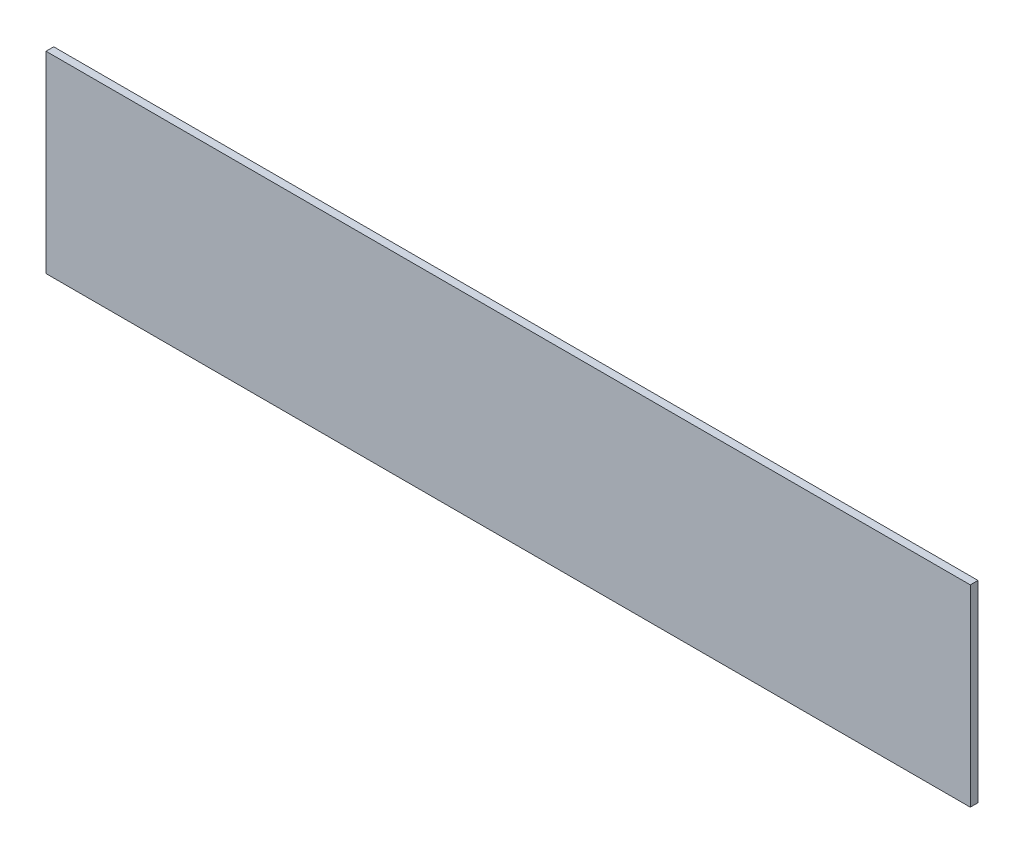
ISO-10303-21;
HEADER;
FILE_DESCRIPTION(('STEP AP214'),'2;1');
FILE_NAME('part.step','',(''),(''),'','','');
FILE_SCHEMA(('AUTOMOTIVE_DESIGN { 1 0 10303 214 1 1 1 1 }'));
ENDSEC;
DATA;
#1=APPLICATION_CONTEXT('core data for automotive mechanical design processes');
#2=APPLICATION_PROTOCOL_DEFINITION('international standard','automotive_design',2000,#1);
#3=PRODUCT_CONTEXT('',#1,'mechanical');
#4=PRODUCT('Part','Part','',(#3));
#5=PRODUCT_RELATED_PRODUCT_CATEGORY('part','',(#4));
#6=PRODUCT_DEFINITION_FORMATION('','',#4);
#7=PRODUCT_DEFINITION_CONTEXT('part definition',#1,'design');
#8=PRODUCT_DEFINITION('design','',#6,#7);
#9=PRODUCT_DEFINITION_SHAPE('','',#8);
#10=(LENGTH_UNIT() NAMED_UNIT(*) SI_UNIT(.MILLI.,.METRE.));
#11=(NAMED_UNIT(*) PLANE_ANGLE_UNIT() SI_UNIT($,.RADIAN.));
#12=(NAMED_UNIT(*) SI_UNIT($,.STERADIAN.) SOLID_ANGLE_UNIT());
#13=UNCERTAINTY_MEASURE_WITH_UNIT(LENGTH_MEASURE(1.E-05),#10,'distance_accuracy_value','');
#14=(GEOMETRIC_REPRESENTATION_CONTEXT(3) GLOBAL_UNCERTAINTY_ASSIGNED_CONTEXT((#13)) GLOBAL_UNIT_ASSIGNED_CONTEXT((#10,
#11,#12)) REPRESENTATION_CONTEXT('',''));
#15=CARTESIAN_POINT('',(0.,0.,0.));
#16=DIRECTION('',(0.,0.,1.));
#17=DIRECTION('',(1.,0.,0.));
#18=AXIS2_PLACEMENT_3D('',#15,#16,#17);
#19=CARTESIAN_POINT('',(0.,0.,-20.));
#20=DIRECTION('',(-1.,0.,0.));
#21=DIRECTION('',(0.,-1.,0.));
#22=AXIS2_PLACEMENT_3D('',#19,#20,#21);
#23=PLANE('',#22);
#24=DIRECTION('',(0.,-1.,0.));
#25=VECTOR('',#24,1.);
#26=CARTESIAN_POINT('',(0.,0.,0.));
#27=LINE('',#26,#25);
#28=CARTESIAN_POINT('',(0.,0.,0.));
#29=VERTEX_POINT('',#28);
#30=CARTESIAN_POINT('',(0.,-500.,0.));
#31=VERTEX_POINT('',#30);
#32=EDGE_CURVE('E103',#29,#31,#27,.T.);
#33=ORIENTED_EDGE('',*,*,#32,.F.);
#34=DIRECTION('',(0.,0.,1.));
#35=VECTOR('',#34,1.);
#36=CARTESIAN_POINT('',(0.,0.,-20.));
#37=LINE('',#36,#35);
#38=CARTESIAN_POINT('',(0.,0.,-20.));
#39=VERTEX_POINT('',#38);
#40=EDGE_CURVE('E11',#39,#29,#37,.T.);
#41=ORIENTED_EDGE('',*,*,#40,.F.);
#42=DIRECTION('',(0.,-1.,0.));
#43=VECTOR('',#42,1.);
#44=CARTESIAN_POINT('',(0.,0.,-20.));
#45=LINE('',#44,#43);
#46=CARTESIAN_POINT('',(0.,-500.,-20.));
#47=VERTEX_POINT('',#46);
#48=EDGE_CURVE('E97',#39,#47,#45,.T.);
#49=ORIENTED_EDGE('',*,*,#48,.T.);
#50=DIRECTION('',(0.,0.,1.));
#51=VECTOR('',#50,1.);
#52=CARTESIAN_POINT('',(0.,-500.,-20.));
#53=LINE('',#52,#51);
#54=EDGE_CURVE('E42',#47,#31,#53,.T.);
#55=ORIENTED_EDGE('',*,*,#54,.T.);
#56=EDGE_LOOP('',(#33,#41,#49,#55));
#57=FACE_BOUND('',#56,.T.);
#58=ADVANCED_FACE('F39',(#57),#23,.T.);
#59=CARTESIAN_POINT('',(0.,0.,-20.));
#60=DIRECTION('',(0.,1.,0.));
#61=DIRECTION('',(0.,0.,1.));
#62=AXIS2_PLACEMENT_3D('',#59,#60,#61);
#63=PLANE('',#62);
#64=DIRECTION('',(-1.,0.,0.));
#65=VECTOR('',#64,1.);
#66=CARTESIAN_POINT('',(0.,0.,0.));
#67=LINE('',#66,#65);
#68=CARTESIAN_POINT('',(2400.,0.,0.));
#69=VERTEX_POINT('',#68);
#70=EDGE_CURVE('E99',#69,#29,#67,.T.);
#71=ORIENTED_EDGE('',*,*,#70,.F.);
#72=DIRECTION('',(0.,0.,1.));
#73=VECTOR('',#72,1.);
#74=CARTESIAN_POINT('',(2400.,0.,-20.));
#75=LINE('',#74,#73);
#76=CARTESIAN_POINT('',(2400.,0.,-20.));
#77=VERTEX_POINT('',#76);
#78=EDGE_CURVE('E48',#77,#69,#75,.T.);
#79=ORIENTED_EDGE('',*,*,#78,.F.);
#80=DIRECTION('',(-1.,0.,0.));
#81=VECTOR('',#80,1.);
#82=CARTESIAN_POINT('',(0.,0.,-20.));
#83=LINE('',#82,#81);
#84=EDGE_CURVE('E94',#77,#39,#83,.T.);
#85=ORIENTED_EDGE('',*,*,#84,.T.);
#86=ORIENTED_EDGE('',*,*,#40,.T.);
#87=EDGE_LOOP('',(#71,#79,#85,#86));
#88=FACE_BOUND('',#87,.T.);
#89=ADVANCED_FACE('F113',(#88),#63,.T.);
#90=CARTESIAN_POINT('',(2400.,0.,-20.));
#91=DIRECTION('',(1.,0.,0.));
#92=DIRECTION('',(0.,0.,-1.));
#93=AXIS2_PLACEMENT_3D('',#90,#91,#92);
#94=PLANE('',#93);
#95=DIRECTION('',(0.,1.,0.));
#96=VECTOR('',#95,1.);
#97=CARTESIAN_POINT('',(2400.,0.,0.));
#98=LINE('',#97,#96);
#99=CARTESIAN_POINT('',(2400.,-500.,0.));
#100=VERTEX_POINT('',#99);
#101=EDGE_CURVE('E89',#100,#69,#98,.T.);
#102=ORIENTED_EDGE('',*,*,#101,.F.);
#103=DIRECTION('',(0.,0.,1.));
#104=VECTOR('',#103,1.);
#105=CARTESIAN_POINT('',(2400.,-500.,-20.));
#106=LINE('',#105,#104);
#107=CARTESIAN_POINT('',(2400.,-500.,-20.));
#108=VERTEX_POINT('',#107);
#109=EDGE_CURVE('E84',#108,#100,#106,.T.);
#110=ORIENTED_EDGE('',*,*,#109,.F.);
#111=DIRECTION('',(0.,1.,0.));
#112=VECTOR('',#111,1.);
#113=CARTESIAN_POINT('',(2400.,0.,-20.));
#114=LINE('',#113,#112);
#115=EDGE_CURVE('E87',#108,#77,#114,.T.);
#116=ORIENTED_EDGE('',*,*,#115,.T.);
#117=ORIENTED_EDGE('',*,*,#78,.T.);
#118=EDGE_LOOP('',(#102,#110,#116,#117));
#119=FACE_BOUND('',#118,.T.);
#120=ADVANCED_FACE('F86',(#119),#94,.T.);
#121=CARTESIAN_POINT('',(0.,-500.,-20.));
#122=DIRECTION('',(0.,-1.,0.));
#123=DIRECTION('',(0.,0.,-1.));
#124=AXIS2_PLACEMENT_3D('',#121,#122,#123);
#125=PLANE('',#124);
#126=DIRECTION('',(1.,0.,0.));
#127=VECTOR('',#126,1.);
#128=CARTESIAN_POINT('',(0.,-500.,0.));
#129=LINE('',#128,#127);
#130=EDGE_CURVE('E106',#31,#100,#129,.T.);
#131=ORIENTED_EDGE('',*,*,#130,.F.);
#132=ORIENTED_EDGE('',*,*,#54,.F.);
#133=DIRECTION('',(1.,0.,0.));
#134=VECTOR('',#133,1.);
#135=CARTESIAN_POINT('',(0.,-500.,-20.));
#136=LINE('',#135,#134);
#137=EDGE_CURVE('E93',#47,#108,#136,.T.);
#138=ORIENTED_EDGE('',*,*,#137,.T.);
#139=ORIENTED_EDGE('',*,*,#109,.T.);
#140=EDGE_LOOP('',(#131,#132,#138,#139));
#141=FACE_BOUND('',#140,.T.);
#142=ADVANCED_FACE('F96',(#141),#125,.T.);
#143=CARTESIAN_POINT('',(0.,0.,-20.));
#144=DIRECTION('',(0.,0.,1.));
#145=DIRECTION('',(1.,0.,0.));
#146=AXIS2_PLACEMENT_3D('',#143,#144,#145);
#147=PLANE('',#146);
#148=ORIENTED_EDGE('',*,*,#48,.F.);
#149=ORIENTED_EDGE('',*,*,#84,.F.);
#150=ORIENTED_EDGE('',*,*,#115,.F.);
#151=ORIENTED_EDGE('',*,*,#137,.F.);
#152=EDGE_LOOP('',(#148,#149,#150,#151));
#153=FACE_BOUND('',#152,.T.);
#154=ADVANCED_FACE('F92',(#153),#147,.F.);
#155=CARTESIAN_POINT('',(0.,0.,0.));
#156=DIRECTION('',(0.,0.,1.));
#157=DIRECTION('',(1.,0.,0.));
#158=AXIS2_PLACEMENT_3D('',#155,#156,#157);
#159=PLANE('',#158);
#160=ORIENTED_EDGE('',*,*,#32,.T.);
#161=ORIENTED_EDGE('',*,*,#130,.T.);
#162=ORIENTED_EDGE('',*,*,#101,.T.);
#163=ORIENTED_EDGE('',*,*,#70,.T.);
#164=EDGE_LOOP('',(#160,#161,#162,#163));
#165=FACE_BOUND('',#164,.T.);
#166=ADVANCED_FACE('F112',(#165),#159,.T.);
#167=CLOSED_SHELL('',(#58,#89,#120,#142,#154,#166));
#168=MANIFOLD_SOLID_BREP('B2',#167);
#169=ADVANCED_BREP_SHAPE_REPRESENTATION('',(#18,#168),#14);
#170=SHAPE_DEFINITION_REPRESENTATION(#9,#169);
ENDSEC;
END-ISO-10303-21;
